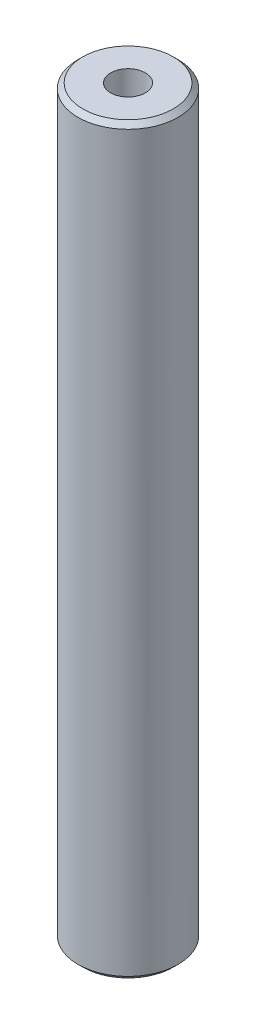
ISO-10303-21;
HEADER;
FILE_DESCRIPTION(('STEP AP214'),'2;1');
FILE_NAME('part.step','',(''),(''),'','','');
FILE_SCHEMA(('AUTOMOTIVE_DESIGN { 1 0 10303 214 1 1 1 1 }'));
ENDSEC;
DATA;
#1=APPLICATION_CONTEXT('core data for automotive mechanical design processes');
#2=APPLICATION_PROTOCOL_DEFINITION('international standard','automotive_design',2000,#1);
#3=PRODUCT_CONTEXT('',#1,'mechanical');
#4=PRODUCT('Part','Part','',(#3));
#5=PRODUCT_RELATED_PRODUCT_CATEGORY('part','',(#4));
#6=PRODUCT_DEFINITION_FORMATION('','',#4);
#7=PRODUCT_DEFINITION_CONTEXT('part definition',#1,'design');
#8=PRODUCT_DEFINITION('design','',#6,#7);
#9=PRODUCT_DEFINITION_SHAPE('','',#8);
#10=(LENGTH_UNIT() NAMED_UNIT(*) SI_UNIT(.MILLI.,.METRE.));
#11=(NAMED_UNIT(*) PLANE_ANGLE_UNIT() SI_UNIT($,.RADIAN.));
#12=(NAMED_UNIT(*) SI_UNIT($,.STERADIAN.) SOLID_ANGLE_UNIT());
#13=UNCERTAINTY_MEASURE_WITH_UNIT(LENGTH_MEASURE(1.E-05),#10,'distance_accuracy_value','');
#14=(GEOMETRIC_REPRESENTATION_CONTEXT(3) GLOBAL_UNCERTAINTY_ASSIGNED_CONTEXT((#13)) GLOBAL_UNIT_ASSIGNED_CONTEXT((#10,
#11,#12)) REPRESENTATION_CONTEXT('',''));
#15=CARTESIAN_POINT('',(0.,0.,0.));
#16=DIRECTION('',(0.,0.,1.));
#17=DIRECTION('',(1.,0.,0.));
#18=AXIS2_PLACEMENT_3D('',#15,#16,#17);
#19=CARTESIAN_POINT('',(0.,556.930735760121,0.));
#20=DIRECTION('',(0.,-1.,0.));
#21=DIRECTION('',(0.,0.,-1.));
#22=AXIS2_PLACEMENT_3D('',#19,#20,#21);
#23=CYLINDRICAL_SURFACE('',#22,37.5);
#24=CARTESIAN_POINT('',(0.,553.290557107845,0.));
#25=DIRECTION('',(0.,1.,0.));
#26=DIRECTION('',(0.,0.,1.));
#27=AXIS2_PLACEMENT_3D('',#24,#25,#26);
#28=CIRCLE('',#27,37.5);
#29=CARTESIAN_POINT('',(0.,553.290557107845,-37.5000000000001));
#30=VERTEX_POINT('',#29);
#31=EDGE_CURVE('E50',#30,#30,#28,.F.);
#32=ORIENTED_EDGE('',*,*,#31,.T.);
#33=EDGE_LOOP('',(#32));
#34=FACE_BOUND('',#33,.T.);
#35=CARTESIAN_POINT('',(0.,3.64017865227506,0.));
#36=DIRECTION('',(0.,1.,0.));
#37=DIRECTION('',(0.,0.,1.));
#38=AXIS2_PLACEMENT_3D('',#35,#36,#37);
#39=CIRCLE('',#38,37.5);
#40=CARTESIAN_POINT('',(0.,3.64017865227506,37.5));
#41=VERTEX_POINT('',#40);
#42=EDGE_CURVE('E51',#41,#41,#39,.T.);
#43=ORIENTED_EDGE('',*,*,#42,.T.);
#44=EDGE_LOOP('',(#43));
#45=FACE_BOUND('',#44,.T.);
#46=ADVANCED_FACE('F39',(#34,#45),#23,.T.);
#47=CARTESIAN_POINT('',(0.,556.930735760121,0.));
#48=DIRECTION('',(0.,1.,0.));
#49=DIRECTION('',(0.,0.,1.));
#50=AXIS2_PLACEMENT_3D('',#47,#48,#49);
#51=PLANE('',#50);
#52=CARTESIAN_POINT('',(0.,556.930735760121,0.));
#53=DIRECTION('',(0.,1.,0.));
#54=DIRECTION('',(0.,0.,1.));
#55=AXIS2_PLACEMENT_3D('',#52,#53,#54);
#56=CIRCLE('',#55,33.8598213477249);
#57=CARTESIAN_POINT('',(0.,556.930735760121,-33.8598213477249));
#58=VERTEX_POINT('',#57);
#59=EDGE_CURVE('E54',#58,#58,#56,.T.);
#60=ORIENTED_EDGE('',*,*,#59,.T.);
#61=EDGE_LOOP('',(#60));
#62=FACE_BOUND('',#61,.T.);
#63=CARTESIAN_POINT('',(0.,556.930735760121,0.));
#64=DIRECTION('',(0.,1.,0.));
#65=DIRECTION('',(0.,0.,1.));
#66=AXIS2_PLACEMENT_3D('',#63,#64,#65);
#67=CIRCLE('',#66,13.0119521478798);
#68=CARTESIAN_POINT('',(0.,556.930735760121,13.0119521478798));
#69=VERTEX_POINT('',#68);
#70=EDGE_CURVE('E58',#69,#69,#67,.T.);
#71=ORIENTED_EDGE('',*,*,#70,.F.);
#72=EDGE_LOOP('',(#71));
#73=FACE_BOUND('',#72,.T.);
#74=ADVANCED_FACE('F69',(#62,#73),#51,.T.);
#75=CARTESIAN_POINT('',(0.,0.,0.));
#76=DIRECTION('',(0.,1.,0.));
#77=DIRECTION('',(0.,0.,1.));
#78=AXIS2_PLACEMENT_3D('',#75,#76,#77);
#79=PLANE('',#78);
#80=CARTESIAN_POINT('',(0.,0.,0.));
#81=DIRECTION('',(0.,1.,0.));
#82=DIRECTION('',(0.,0.,1.));
#83=AXIS2_PLACEMENT_3D('',#80,#81,#82);
#84=CIRCLE('',#83,33.8598213477249);
#85=CARTESIAN_POINT('',(0.,0.,33.8598213477249));
#86=VERTEX_POINT('',#85);
#87=EDGE_CURVE('E10',#86,#86,#84,.F.);
#88=ORIENTED_EDGE('',*,*,#87,.T.);
#89=EDGE_LOOP('',(#88));
#90=FACE_BOUND('',#89,.T.);
#91=CARTESIAN_POINT('',(0.,0.,0.));
#92=DIRECTION('',(0.,1.,0.));
#93=DIRECTION('',(0.,0.,1.));
#94=AXIS2_PLACEMENT_3D('',#91,#92,#93);
#95=CIRCLE('',#94,13.0119521478798);
#96=CARTESIAN_POINT('',(0.,0.,13.0119521478798));
#97=VERTEX_POINT('',#96);
#98=EDGE_CURVE('E63',#97,#97,#95,.T.);
#99=ORIENTED_EDGE('',*,*,#98,.T.);
#100=EDGE_LOOP('',(#99));
#101=FACE_BOUND('',#100,.T.);
#102=ADVANCED_FACE('F75',(#90,#101),#79,.F.);
#103=CARTESIAN_POINT('',(0.,556.930735760121,0.));
#104=DIRECTION('',(0.,-1.,0.));
#105=DIRECTION('',(0.,0.,-1.));
#106=AXIS2_PLACEMENT_3D('',#103,#104,#105);
#107=CYLINDRICAL_SURFACE('',#106,13.0119521478798);
#108=ORIENTED_EDGE('',*,*,#70,.T.);
#109=EDGE_LOOP('',(#108));
#110=FACE_BOUND('',#109,.T.);
#111=ORIENTED_EDGE('',*,*,#98,.F.);
#112=EDGE_LOOP('',(#111));
#113=FACE_BOUND('',#112,.T.);
#114=ADVANCED_FACE('F70',(#110,#113),#107,.F.);
#115=CARTESIAN_POINT('',(0.,556.930735760121,0.));
#116=DIRECTION('',(0.,-1.,0.));
#117=DIRECTION('',(0.,0.,-1.));
#118=AXIS2_PLACEMENT_3D('',#115,#116,#117);
#119=CONICAL_SURFACE('',#118,33.8598213477249,0.785398163397445);
#120=CARTESIAN_POINT('',(0.,553.290557107845,-37.5000000000001));
#121=CARTESIAN_POINT('',(0.,553.328475635473,-37.4620814723722));
#122=CARTESIAN_POINT('',(0.,553.366394163101,-37.4241629447443));
#123=CARTESIAN_POINT('',(0.,553.442231218357,-37.3483258894886));
#124=CARTESIAN_POINT('',(0.,553.480149745985,-37.3104073618607));
#125=CARTESIAN_POINT('',(0.,553.55598680124,-37.234570306605));
#126=CARTESIAN_POINT('',(0.,553.593905328868,-37.1966517789771));
#127=CARTESIAN_POINT('',(0.,553.669742384124,-37.1208147237214));
#128=CARTESIAN_POINT('',(0.,553.707660911752,-37.0828961960935));
#129=CARTESIAN_POINT('',(0.,553.783497967008,-37.0070591408378));
#130=CARTESIAN_POINT('',(0.,553.821416494635,-36.9691406132099));
#131=CARTESIAN_POINT('',(0.,553.897253549891,-36.8933035579542));
#132=CARTESIAN_POINT('',(0.,553.935172077519,-36.8553850303263));
#133=CARTESIAN_POINT('',(0.,554.011009132775,-36.7795479750706));
#134=CARTESIAN_POINT('',(0.,554.048927660403,-36.7416294474427));
#135=CARTESIAN_POINT('',(0.,554.124764715658,-36.665792392187));
#136=CARTESIAN_POINT('',(0.,554.162683243286,-36.6278738645591));
#137=CARTESIAN_POINT('',(0.,554.238520298542,-36.5520368093034));
#138=CARTESIAN_POINT('',(0.,554.27643882617,-36.5141182816756));
#139=CARTESIAN_POINT('',(0.,554.352275881425,-36.4382812264198));
#140=CARTESIAN_POINT('',(0.,554.390194409053,-36.4003626987919));
#141=CARTESIAN_POINT('',(0.,554.466031464309,-36.3245256435362));
#142=CARTESIAN_POINT('',(0.,554.503949991937,-36.2866071159083));
#143=CARTESIAN_POINT('',(0.,554.579787047193,-36.2107700606526));
#144=CARTESIAN_POINT('',(0.,554.617705574821,-36.1728515330247));
#145=CARTESIAN_POINT('',(0.,554.693542630076,-36.097014477769));
#146=CARTESIAN_POINT('',(0.,554.731461157704,-36.0590959501412));
#147=CARTESIAN_POINT('',(0.,554.80729821296,-35.9832588948854));
#148=CARTESIAN_POINT('',(0.,554.845216740588,-35.9453403672575));
#149=CARTESIAN_POINT('',(0.,554.921053795844,-35.8695033120018));
#150=CARTESIAN_POINT('',(0.,554.958972323471,-35.8315847843739));
#151=CARTESIAN_POINT('',(0.,555.034809378727,-35.7557477291182));
#152=CARTESIAN_POINT('',(0.,555.072727906355,-35.7178292014904));
#153=CARTESIAN_POINT('',(0.,555.148564961611,-35.6419921462346));
#154=CARTESIAN_POINT('',(0.,555.186483489239,-35.6040736186068));
#155=CARTESIAN_POINT('',(0.,555.262320544494,-35.528236563351));
#156=CARTESIAN_POINT('',(0.,555.300239072122,-35.4903180357232));
#157=CARTESIAN_POINT('',(0.,555.376076127378,-35.4144809804674));
#158=CARTESIAN_POINT('',(0.,555.413994655006,-35.3765624528396));
#159=CARTESIAN_POINT('',(0.,555.489831710262,-35.3007253975838));
#160=CARTESIAN_POINT('',(0.,555.527750237889,-35.262806869956));
#161=CARTESIAN_POINT('',(0.,555.603587293145,-35.1869698147002));
#162=CARTESIAN_POINT('',(0.,555.641505820773,-35.1490512870724));
#163=CARTESIAN_POINT('',(0.,555.717342876029,-35.0732142318166));
#164=CARTESIAN_POINT('',(0.,555.755261403657,-35.0352957041888));
#165=CARTESIAN_POINT('',(0.,555.831098458912,-34.959458648933));
#166=CARTESIAN_POINT('',(0.,555.86901698654,-34.9215401213052));
#167=CARTESIAN_POINT('',(0.,555.944854041796,-34.8457030660494));
#168=CARTESIAN_POINT('',(0.,555.982772569424,-34.8077845384216));
#169=CARTESIAN_POINT('',(0.,556.05860962468,-34.7319474831658));
#170=CARTESIAN_POINT('',(0.,556.096528152307,-34.694028955538));
#171=CARTESIAN_POINT('',(0.,556.172365207563,-34.6181919002822));
#172=CARTESIAN_POINT('',(0.,556.210283735191,-34.5802733726544));
#173=CARTESIAN_POINT('',(0.,556.286120790447,-34.5044363173986));
#174=CARTESIAN_POINT('',(0.,556.324039318075,-34.4665177897708));
#175=CARTESIAN_POINT('',(0.,556.39987637333,-34.3906807345151));
#176=CARTESIAN_POINT('',(0.,556.437794900958,-34.3527622068872));
#177=CARTESIAN_POINT('',(0.,556.513631956214,-34.2769251516314));
#178=CARTESIAN_POINT('',(0.,556.551550483842,-34.2390066240036));
#179=CARTESIAN_POINT('',(0.,556.627387539098,-34.1631695687478));
#180=CARTESIAN_POINT('',(0.,556.665306066725,-34.12525104112));
#181=CARTESIAN_POINT('',(0.,556.741143121981,-34.0494139858642));
#182=CARTESIAN_POINT('',(0.,556.779061649609,-34.0114954582364));
#183=CARTESIAN_POINT('',(0.,556.854898704865,-33.9356584029806));
#184=CARTESIAN_POINT('',(0.,556.892817232493,-33.8977398753528));
#185=CARTESIAN_POINT('',(0.,556.930735760121,-33.8598213477249));
#186=B_SPLINE_CURVE_WITH_KNOTS('',3,(#120,#121,#122,#123,#124,#125,#126,#127,#128,#129,#130,
#131,#132,#133,#134,#135,#136,#137,#138,#139,#140,#141,#142,#143,#144,#145,#146,#147,#148,#149,
#150,#151,#152,#153,#154,#155,#156,#157,#158,#159,#160,#161,#162,#163,#164,#165,#166,#167,#168,
#169,#170,#171,#172,#173,#174,#175,#176,#177,#178,#179,#180,#181,#182,#183,#184,#185),
.UNSPECIFIED.,.F.,.F.,(4,2,2,2,2,2,2,2,2,2,2,2,2,2,2,2,2,2,2,2,2,2,2,2,2,2,2,2,2,2,2,2,4),(0.,
0.160874688109579,0.321749376219241,0.482624064328898,0.643498752438561,0.804373440548139,
0.965248128657797,1.12612281676746,1.28699750487712,1.44787219298677,1.60874688109636,
1.76962156920602,1.93049625731567,2.09137094542533,2.25224563353491,2.41312032164458,
2.57399500975423,2.73486969786389,2.89574438597355,3.05661907408313,3.21749376219279,
3.37836845030245,3.53924313841211,3.70011782652169,3.86099251463135,4.02186720274101,
4.18274189085067,4.34361657896033,4.50449126706991,4.66536595517957,4.82624064328922,
4.98711533139889,5.14799001950854),.UNSPECIFIED.);
#187=EDGE_CURVE('BSEAM81',#30,#58,#186,.T.);
#188=ORIENTED_EDGE('',*,*,#31,.F.);
#189=ORIENTED_EDGE('',*,*,#59,.F.);
#190=ORIENTED_EDGE('',*,*,#187,.T.);
#191=ORIENTED_EDGE('',*,*,#187,.F.);
#192=EDGE_LOOP('',(#188,#190,#189,#191));
#193=FACE_BOUND('',#192,.T.);
#194=ADVANCED_FACE('F81',(#193),#119,.T.);
#195=CARTESIAN_POINT('',(0.,3.64017865227506,0.));
#196=DIRECTION('',(0.,1.,0.));
#197=DIRECTION('',(0.,0.,1.));
#198=AXIS2_PLACEMENT_3D('',#195,#196,#197);
#199=CONICAL_SURFACE('',#198,37.5,0.78539816339746);
#200=ORIENTED_EDGE('',*,*,#87,.F.);
#201=EDGE_LOOP('',(#200));
#202=FACE_BOUND('',#201,.T.);
#203=ORIENTED_EDGE('',*,*,#42,.F.);
#204=EDGE_LOOP('',(#203));
#205=FACE_BOUND('',#204,.T.);
#206=ADVANCED_FACE('F45',(#202,#205),#199,.T.);
#207=CLOSED_SHELL('',(#46,#74,#102,#114,#194,#206));
#208=MANIFOLD_SOLID_BREP('B2',#207);
#209=ADVANCED_BREP_SHAPE_REPRESENTATION('',(#18,#208),#14);
#210=SHAPE_DEFINITION_REPRESENTATION(#9,#209);
ENDSEC;
END-ISO-10303-21;
